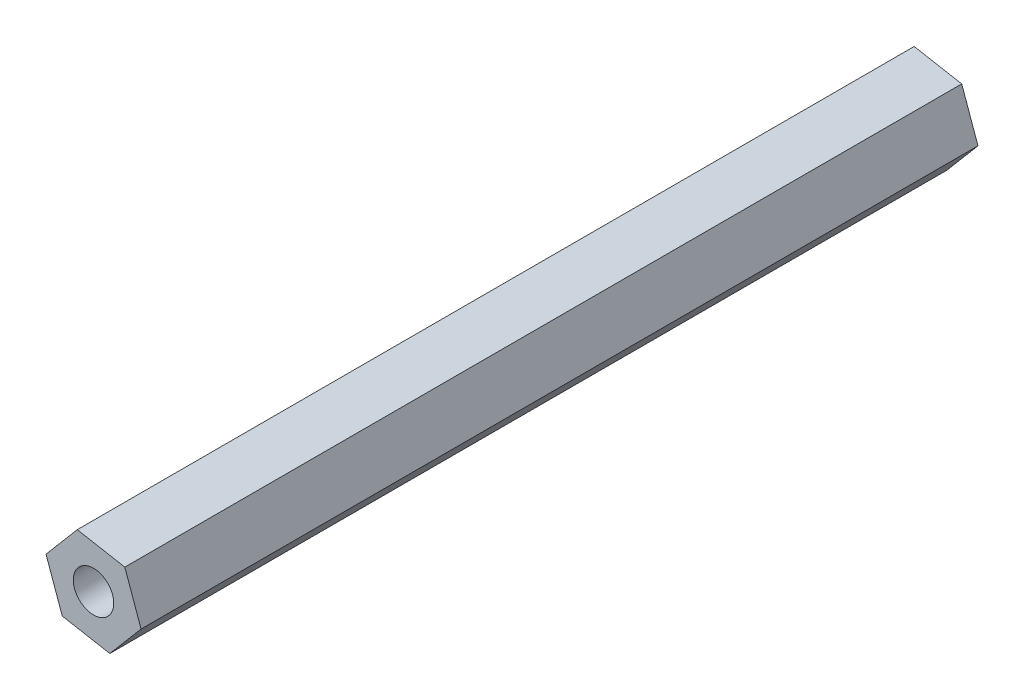
ISO-10303-21;
HEADER;
FILE_DESCRIPTION(('STEP AP214'),'2;1');
FILE_NAME('part.step','',(''),(''),'','','');
FILE_SCHEMA(('AUTOMOTIVE_DESIGN { 1 0 10303 214 1 1 1 1 }'));
ENDSEC;
DATA;
#1=APPLICATION_CONTEXT('core data for automotive mechanical design processes');
#2=APPLICATION_PROTOCOL_DEFINITION('international standard','automotive_design',2000,#1);
#3=PRODUCT_CONTEXT('',#1,'mechanical');
#4=PRODUCT('Part','Part','',(#3));
#5=PRODUCT_RELATED_PRODUCT_CATEGORY('part','',(#4));
#6=PRODUCT_DEFINITION_FORMATION('','',#4);
#7=PRODUCT_DEFINITION_CONTEXT('part definition',#1,'design');
#8=PRODUCT_DEFINITION('design','',#6,#7);
#9=PRODUCT_DEFINITION_SHAPE('','',#8);
#10=(LENGTH_UNIT() NAMED_UNIT(*) SI_UNIT(.MILLI.,.METRE.));
#11=(NAMED_UNIT(*) PLANE_ANGLE_UNIT() SI_UNIT($,.RADIAN.));
#12=(NAMED_UNIT(*) SI_UNIT($,.STERADIAN.) SOLID_ANGLE_UNIT());
#13=UNCERTAINTY_MEASURE_WITH_UNIT(LENGTH_MEASURE(1.E-05),#10,'distance_accuracy_value','');
#14=(GEOMETRIC_REPRESENTATION_CONTEXT(3) GLOBAL_UNCERTAINTY_ASSIGNED_CONTEXT((#13)) GLOBAL_UNIT_ASSIGNED_CONTEXT((#10,
#11,#12)) REPRESENTATION_CONTEXT('',''));
#15=CARTESIAN_POINT('',(0.,0.,0.));
#16=DIRECTION('',(0.,0.,1.));
#17=DIRECTION('',(1.,0.,0.));
#18=AXIS2_PLACEMENT_3D('',#15,#16,#17);
#19=CARTESIAN_POINT('',(14.100105118259,-7.40552271774973,60.));
#20=DIRECTION('',(-0.941553473498977,-0.336863557753005,0.));
#21=DIRECTION('',(0.336863557753005,-0.941553473498977,0.));
#22=AXIS2_PLACEMENT_3D('',#19,#20,#21);
#23=PLANE('',#22);
#24=DIRECTION('',(-0.336863557753005,0.941553473498977,0.));
#25=VECTOR('',#24,1.);
#26=CARTESIAN_POINT('',(14.100105118259,-7.40552271774973,0.));
#27=LINE('',#26,#25);
#28=CARTESIAN_POINT('',(14.100105118259,-7.40552271774973,0.));
#29=VERTEX_POINT('',#28);
#30=CARTESIAN_POINT('',(12.9331755237658,-4.14388580946336,0.));
#31=VERTEX_POINT('',#30);
#32=EDGE_CURVE('E117',#29,#31,#27,.T.);
#33=ORIENTED_EDGE('',*,*,#32,.T.);
#34=DIRECTION('',(0.,0.,-1.));
#35=VECTOR('',#34,1.);
#36=CARTESIAN_POINT('',(12.9331755237658,-4.14388580946336,60.));
#37=LINE('',#36,#35);
#38=CARTESIAN_POINT('',(12.9331755237658,-4.14388580946336,60.));
#39=VERTEX_POINT('',#38);
#40=EDGE_CURVE('E11',#39,#31,#37,.T.);
#41=ORIENTED_EDGE('',*,*,#40,.F.);
#42=DIRECTION('',(-0.336863557753005,0.941553473498977,0.));
#43=VECTOR('',#42,1.);
#44=CARTESIAN_POINT('',(14.100105118259,-7.40552271774973,60.));
#45=LINE('',#44,#43);
#46=CARTESIAN_POINT('',(14.100105118259,-7.40552271774973,60.));
#47=VERTEX_POINT('',#46);
#48=EDGE_CURVE('E128',#47,#39,#45,.T.);
#49=ORIENTED_EDGE('',*,*,#48,.F.);
#50=DIRECTION('',(0.,0.,-1.));
#51=VECTOR('',#50,1.);
#52=CARTESIAN_POINT('',(14.100105118259,-7.40552271774973,60.));
#53=LINE('',#52,#51);
#54=EDGE_CURVE('E113',#47,#29,#53,.T.);
#55=ORIENTED_EDGE('',*,*,#54,.T.);
#56=EDGE_LOOP('',(#33,#41,#49,#55));
#57=FACE_BOUND('',#56,.T.);
#58=ADVANCED_FACE('F33',(#57),#23,.F.);
#59=CARTESIAN_POINT('',(12.9331755237658,-4.14388580946336,60.));
#60=DIRECTION('',(-0.17904433812618,-0.983841005948094,0.));
#61=DIRECTION('',(0.983841005948094,-0.17904433812618,0.));
#62=AXIS2_PLACEMENT_3D('',#59,#60,#61);
#63=PLANE('',#62);
#64=DIRECTION('',(-0.983841005948094,0.17904433812618,0.));
#65=VECTOR('',#64,1.);
#66=CARTESIAN_POINT('',(12.9331755237658,-4.14388580946336,0.));
#67=LINE('',#66,#65);
#68=CARTESIAN_POINT('',(9.52505030602222,-3.52365802857919,0.));
#69=VERTEX_POINT('',#68);
#70=EDGE_CURVE('E120',#31,#69,#67,.T.);
#71=ORIENTED_EDGE('',*,*,#70,.T.);
#72=DIRECTION('',(0.,0.,-1.));
#73=VECTOR('',#72,1.);
#74=CARTESIAN_POINT('',(9.52505030602222,-3.52365802857919,60.));
#75=LINE('',#74,#73);
#76=CARTESIAN_POINT('',(9.52505030602222,-3.52365802857919,60.));
#77=VERTEX_POINT('',#76);
#78=EDGE_CURVE('E41',#77,#69,#75,.T.);
#79=ORIENTED_EDGE('',*,*,#78,.F.);
#80=DIRECTION('',(-0.983841005948094,0.17904433812618,0.));
#81=VECTOR('',#80,1.);
#82=CARTESIAN_POINT('',(12.9331755237658,-4.14388580946336,60.));
#83=LINE('',#82,#81);
#84=EDGE_CURVE('E86',#39,#77,#83,.T.);
#85=ORIENTED_EDGE('',*,*,#84,.F.);
#86=ORIENTED_EDGE('',*,*,#40,.T.);
#87=EDGE_LOOP('',(#71,#79,#85,#86));
#88=FACE_BOUND('',#87,.T.);
#89=ADVANCED_FACE('F153',(#88),#63,.F.);
#90=CARTESIAN_POINT('',(9.52505030602222,-3.52365802857919,60.));
#91=DIRECTION('',(0.762509135372797,-0.64697744819509,0.));
#92=DIRECTION('',(0.64697744819509,0.762509135372797,0.));
#93=AXIS2_PLACEMENT_3D('',#90,#91,#92);
#94=PLANE('',#93);
#95=DIRECTION('',(-0.64697744819509,-0.762509135372797,0.));
#96=VECTOR('',#95,1.);
#97=CARTESIAN_POINT('',(9.52505030602222,-3.52365802857919,0.));
#98=LINE('',#97,#96);
#99=CARTESIAN_POINT('',(7.28385468277191,-6.16506715598138,0.));
#100=VERTEX_POINT('',#99);
#101=EDGE_CURVE('E123',#69,#100,#98,.T.);
#102=ORIENTED_EDGE('',*,*,#101,.T.);
#103=DIRECTION('',(0.,0.,-1.));
#104=VECTOR('',#103,1.);
#105=CARTESIAN_POINT('',(7.28385468277191,-6.16506715598138,60.));
#106=LINE('',#105,#104);
#107=CARTESIAN_POINT('',(7.28385468277191,-6.16506715598138,60.));
#108=VERTEX_POINT('',#107);
#109=EDGE_CURVE('E108',#108,#100,#106,.T.);
#110=ORIENTED_EDGE('',*,*,#109,.F.);
#111=DIRECTION('',(-0.64697744819509,-0.762509135372797,0.));
#112=VECTOR('',#111,1.);
#113=CARTESIAN_POINT('',(9.52505030602222,-3.52365802857919,60.));
#114=LINE('',#113,#112);
#115=EDGE_CURVE('E99',#77,#108,#114,.T.);
#116=ORIENTED_EDGE('',*,*,#115,.F.);
#117=ORIENTED_EDGE('',*,*,#78,.T.);
#118=EDGE_LOOP('',(#102,#110,#116,#117));
#119=FACE_BOUND('',#118,.T.);
#120=ADVANCED_FACE('F134',(#119),#94,.F.);
#121=CARTESIAN_POINT('',(7.28385468277191,-6.16506715598138,60.));
#122=DIRECTION('',(0.941553473498977,0.336863557753005,0.));
#123=DIRECTION('',(-0.336863557753005,0.941553473498977,0.));
#124=AXIS2_PLACEMENT_3D('',#121,#122,#123);
#125=PLANE('',#124);
#126=DIRECTION('',(0.336863557753005,-0.941553473498977,0.));
#127=VECTOR('',#126,1.);
#128=CARTESIAN_POINT('',(7.28385468277191,-6.16506715598138,0.));
#129=LINE('',#128,#127);
#130=CARTESIAN_POINT('',(8.45078427726515,-9.42670406426776,0.));
#131=VERTEX_POINT('',#130);
#132=EDGE_CURVE('E107',#100,#131,#129,.T.);
#133=ORIENTED_EDGE('',*,*,#132,.T.);
#134=DIRECTION('',(0.,0.,-1.));
#135=VECTOR('',#134,1.);
#136=CARTESIAN_POINT('',(8.45078427726515,-9.42670406426776,60.));
#137=LINE('',#136,#135);
#138=CARTESIAN_POINT('',(8.45078427726515,-9.42670406426776,60.));
#139=VERTEX_POINT('',#138);
#140=EDGE_CURVE('E104',#139,#131,#137,.T.);
#141=ORIENTED_EDGE('',*,*,#140,.F.);
#142=DIRECTION('',(0.336863557753005,-0.941553473498977,0.));
#143=VECTOR('',#142,1.);
#144=CARTESIAN_POINT('',(7.28385468277191,-6.16506715598138,60.));
#145=LINE('',#144,#143);
#146=EDGE_CURVE('E93',#108,#139,#145,.T.);
#147=ORIENTED_EDGE('',*,*,#146,.F.);
#148=ORIENTED_EDGE('',*,*,#109,.T.);
#149=EDGE_LOOP('',(#133,#141,#147,#148));
#150=FACE_BOUND('',#149,.T.);
#151=ADVANCED_FACE('F105',(#150),#125,.F.);
#152=CARTESIAN_POINT('',(8.45078427726515,-9.42670406426776,60.));
#153=DIRECTION('',(0.17904433812618,0.983841005948094,0.));
#154=DIRECTION('',(-0.983841005948094,0.17904433812618,0.));
#155=AXIS2_PLACEMENT_3D('',#152,#153,#154);
#156=PLANE('',#155);
#157=DIRECTION('',(0.983841005948094,-0.17904433812618,0.));
#158=VECTOR('',#157,1.);
#159=CARTESIAN_POINT('',(8.45078427726515,-9.42670406426776,0.));
#160=LINE('',#159,#158);
#161=CARTESIAN_POINT('',(11.8589094950087,-10.0469318451519,0.));
#162=VERTEX_POINT('',#161);
#163=EDGE_CURVE('E72',#131,#162,#160,.T.);
#164=ORIENTED_EDGE('',*,*,#163,.T.);
#165=DIRECTION('',(0.,0.,-1.));
#166=VECTOR('',#165,1.);
#167=CARTESIAN_POINT('',(11.8589094950087,-10.0469318451519,60.));
#168=LINE('',#167,#166);
#169=CARTESIAN_POINT('',(11.8589094950087,-10.0469318451519,60.));
#170=VERTEX_POINT('',#169);
#171=EDGE_CURVE('E109',#170,#162,#168,.T.);
#172=ORIENTED_EDGE('',*,*,#171,.F.);
#173=DIRECTION('',(0.983841005948094,-0.17904433812618,0.));
#174=VECTOR('',#173,1.);
#175=CARTESIAN_POINT('',(8.45078427726515,-9.42670406426776,60.));
#176=LINE('',#175,#174);
#177=EDGE_CURVE('E97',#139,#170,#176,.T.);
#178=ORIENTED_EDGE('',*,*,#177,.F.);
#179=ORIENTED_EDGE('',*,*,#140,.T.);
#180=EDGE_LOOP('',(#164,#172,#178,#179));
#181=FACE_BOUND('',#180,.T.);
#182=ADVANCED_FACE('F111',(#181),#156,.F.);
#183=CARTESIAN_POINT('',(11.8589094950087,-10.0469318451519,60.));
#184=DIRECTION('',(-0.762509135372797,0.64697744819509,0.));
#185=DIRECTION('',(-0.64697744819509,-0.762509135372797,0.));
#186=AXIS2_PLACEMENT_3D('',#183,#184,#185);
#187=PLANE('',#186);
#188=DIRECTION('',(0.64697744819509,0.762509135372797,0.));
#189=VECTOR('',#188,1.);
#190=CARTESIAN_POINT('',(11.8589094950087,-10.0469318451519,0.));
#191=LINE('',#190,#189);
#192=EDGE_CURVE('E78',#162,#29,#191,.T.);
#193=ORIENTED_EDGE('',*,*,#192,.T.);
#194=ORIENTED_EDGE('',*,*,#54,.F.);
#195=DIRECTION('',(0.64697744819509,0.762509135372797,0.));
#196=VECTOR('',#195,1.);
#197=CARTESIAN_POINT('',(11.8589094950087,-10.0469318451519,60.));
#198=LINE('',#197,#196);
#199=EDGE_CURVE('E49',#170,#47,#198,.T.);
#200=ORIENTED_EDGE('',*,*,#199,.F.);
#201=ORIENTED_EDGE('',*,*,#171,.T.);
#202=EDGE_LOOP('',(#193,#194,#200,#201));
#203=FACE_BOUND('',#202,.T.);
#204=ADVANCED_FACE('F141',(#203),#187,.F.);
#205=CARTESIAN_POINT('',(0.,0.,60.));
#206=DIRECTION('',(0.,0.,1.));
#207=DIRECTION('',(1.,0.,0.));
#208=AXIS2_PLACEMENT_3D('',#205,#206,#207);
#209=PLANE('',#208);
#210=CARTESIAN_POINT('',(10.6919799005155,-6.78529493686556,60.));
#211=DIRECTION('',(0.,0.,-1.));
#212=DIRECTION('',(-1.,0.,0.));
#213=AXIS2_PLACEMENT_3D('',#210,#211,#212);
#214=CIRCLE('',#213,1.45);
#215=CARTESIAN_POINT('',(9.24197990051546,-6.78529493686556,60.));
#216=VERTEX_POINT('',#215);
#217=EDGE_CURVE('E121',#216,#216,#214,.T.);
#218=ORIENTED_EDGE('',*,*,#217,.T.);
#219=EDGE_LOOP('',(#218));
#220=FACE_BOUND('',#219,.T.);
#221=ORIENTED_EDGE('',*,*,#48,.T.);
#222=ORIENTED_EDGE('',*,*,#84,.T.);
#223=ORIENTED_EDGE('',*,*,#115,.T.);
#224=ORIENTED_EDGE('',*,*,#146,.T.);
#225=ORIENTED_EDGE('',*,*,#177,.T.);
#226=ORIENTED_EDGE('',*,*,#199,.T.);
#227=EDGE_LOOP('',(#221,#222,#223,#224,#225,#226));
#228=FACE_BOUND('',#227,.T.);
#229=ADVANCED_FACE('F95',(#220,#228),#209,.T.);
#230=CARTESIAN_POINT('',(0.,0.,0.));
#231=DIRECTION('',(0.,0.,1.));
#232=DIRECTION('',(1.,0.,0.));
#233=AXIS2_PLACEMENT_3D('',#230,#231,#232);
#234=PLANE('',#233);
#235=CARTESIAN_POINT('',(10.6919799005155,-6.78529493686556,0.));
#236=DIRECTION('',(0.,0.,-1.));
#237=DIRECTION('',(-1.,0.,0.));
#238=AXIS2_PLACEMENT_3D('',#235,#236,#237);
#239=CIRCLE('',#238,1.45);
#240=CARTESIAN_POINT('',(9.24197990051546,-6.78529493686556,0.));
#241=VERTEX_POINT('',#240);
#242=EDGE_CURVE('E208',#241,#241,#239,.T.);
#243=ORIENTED_EDGE('',*,*,#242,.F.);
#244=EDGE_LOOP('',(#243));
#245=FACE_BOUND('',#244,.T.);
#246=ORIENTED_EDGE('',*,*,#32,.F.);
#247=ORIENTED_EDGE('',*,*,#192,.F.);
#248=ORIENTED_EDGE('',*,*,#163,.F.);
#249=ORIENTED_EDGE('',*,*,#132,.F.);
#250=ORIENTED_EDGE('',*,*,#101,.F.);
#251=ORIENTED_EDGE('',*,*,#70,.F.);
#252=EDGE_LOOP('',(#246,#247,#248,#249,#250,#251));
#253=FACE_BOUND('',#252,.T.);
#254=ADVANCED_FACE('F137',(#245,#253),#234,.F.);
#255=CARTESIAN_POINT('',(10.6919799005155,-6.78529493686556,60.));
#256=DIRECTION('',(0.,0.,-1.));
#257=DIRECTION('',(-1.,0.,0.));
#258=AXIS2_PLACEMENT_3D('',#255,#256,#257);
#259=CYLINDRICAL_SURFACE('',#258,1.45);
#260=ORIENTED_EDGE('',*,*,#217,.F.);
#261=EDGE_LOOP('',(#260));
#262=FACE_BOUND('',#261,.T.);
#263=ORIENTED_EDGE('',*,*,#242,.T.);
#264=EDGE_LOOP('',(#263));
#265=FACE_BOUND('',#264,.T.);
#266=ADVANCED_FACE('F190',(#262,#265),#259,.F.);
#267=CLOSED_SHELL('',(#58,#89,#120,#151,#182,#204,#229,#254,#266));
#268=MANIFOLD_SOLID_BREP('B2',#267);
#269=ADVANCED_BREP_SHAPE_REPRESENTATION('',(#18,#268),#14);
#270=SHAPE_DEFINITION_REPRESENTATION(#9,#269);
ENDSEC;
END-ISO-10303-21;
